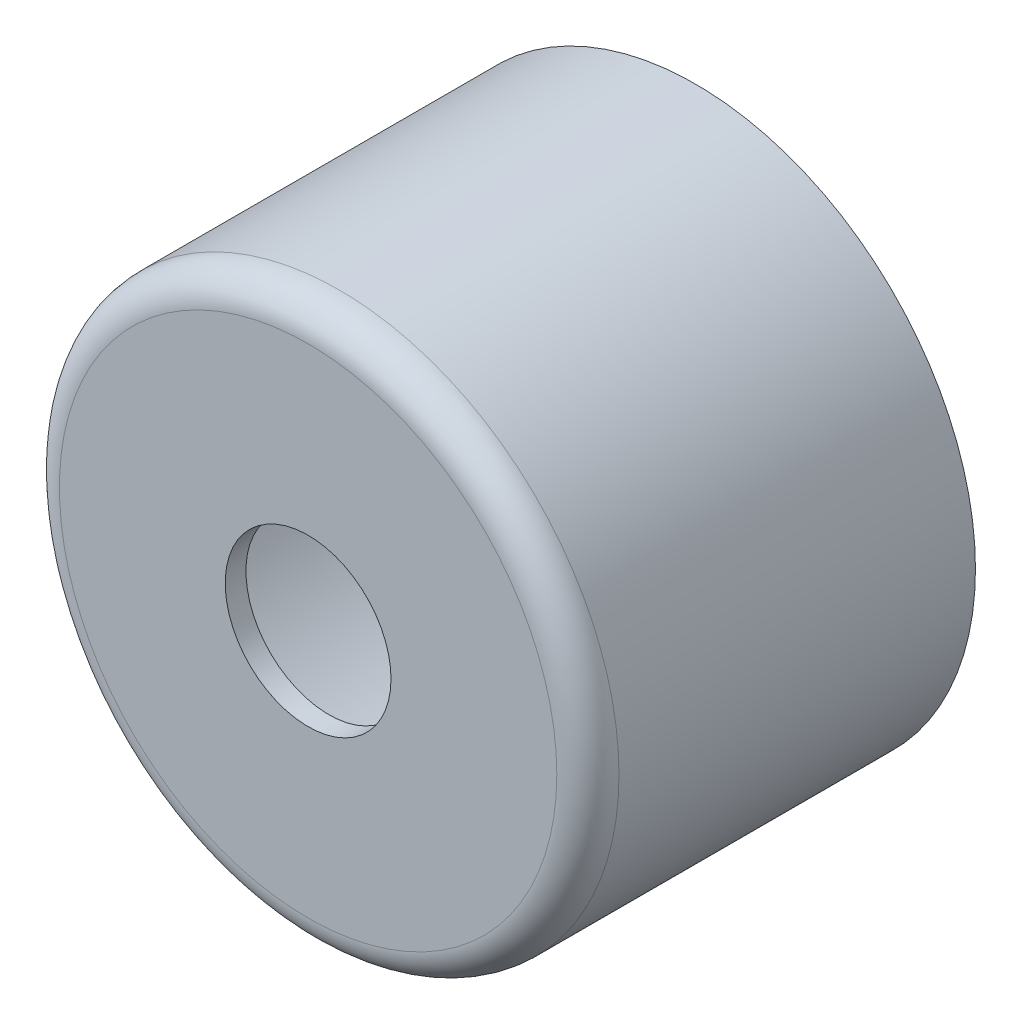
ISO-10303-21;
HEADER;
FILE_DESCRIPTION(('STEP AP214'),'2;1');
FILE_NAME('part.step','',(''),(''),'','','');
FILE_SCHEMA(('AUTOMOTIVE_DESIGN { 1 0 10303 214 1 1 1 1 }'));
ENDSEC;
DATA;
#1=APPLICATION_CONTEXT('core data for automotive mechanical design processes');
#2=APPLICATION_PROTOCOL_DEFINITION('international standard','automotive_design',2000,#1);
#3=PRODUCT_CONTEXT('',#1,'mechanical');
#4=PRODUCT('Part','Part','',(#3));
#5=PRODUCT_RELATED_PRODUCT_CATEGORY('part','',(#4));
#6=PRODUCT_DEFINITION_FORMATION('','',#4);
#7=PRODUCT_DEFINITION_CONTEXT('part definition',#1,'design');
#8=PRODUCT_DEFINITION('design','',#6,#7);
#9=PRODUCT_DEFINITION_SHAPE('','',#8);
#10=(LENGTH_UNIT() NAMED_UNIT(*) SI_UNIT(.MILLI.,.METRE.));
#11=(NAMED_UNIT(*) PLANE_ANGLE_UNIT() SI_UNIT($,.RADIAN.));
#12=(NAMED_UNIT(*) SI_UNIT($,.STERADIAN.) SOLID_ANGLE_UNIT());
#13=UNCERTAINTY_MEASURE_WITH_UNIT(LENGTH_MEASURE(1.E-05),#10,'distance_accuracy_value','');
#14=(GEOMETRIC_REPRESENTATION_CONTEXT(3) GLOBAL_UNCERTAINTY_ASSIGNED_CONTEXT((#13)) GLOBAL_UNIT_ASSIGNED_CONTEXT((#10,
#11,#12)) REPRESENTATION_CONTEXT('',''));
#15=CARTESIAN_POINT('',(0.,0.,0.));
#16=DIRECTION('',(0.,0.,1.));
#17=DIRECTION('',(1.,0.,0.));
#18=AXIS2_PLACEMENT_3D('',#15,#16,#17);
#19=CARTESIAN_POINT('',(0.,0.,18.7));
#20=DIRECTION('',(0.,0.,-1.));
#21=DIRECTION('',(-1.,0.,0.));
#22=AXIS2_PLACEMENT_3D('',#19,#20,#21);
#23=CYLINDRICAL_SURFACE('',#22,13.5);
#24=CARTESIAN_POINT('',(0.,0.,17.2));
#25=DIRECTION('',(0.,0.,1.));
#26=DIRECTION('',(1.,0.,0.));
#27=AXIS2_PLACEMENT_3D('',#24,#25,#26);
#28=CIRCLE('',#27,13.5);
#29=CARTESIAN_POINT('',(13.5,0.,17.2));
#30=VERTEX_POINT('',#29);
#31=EDGE_CURVE('E10',#30,#30,#28,.F.);
#32=ORIENTED_EDGE('',*,*,#31,.T.);
#33=EDGE_LOOP('',(#32));
#34=FACE_BOUND('',#33,.T.);
#35=CARTESIAN_POINT('',(0.,0.,0.));
#36=DIRECTION('',(0.,0.,1.));
#37=DIRECTION('',(1.,0.,0.));
#38=AXIS2_PLACEMENT_3D('',#35,#36,#37);
#39=CIRCLE('',#38,13.5);
#40=CARTESIAN_POINT('',(13.5,0.,0.));
#41=VERTEX_POINT('',#40);
#42=EDGE_CURVE('E41',#41,#41,#39,.T.);
#43=ORIENTED_EDGE('',*,*,#42,.T.);
#44=EDGE_LOOP('',(#43));
#45=FACE_BOUND('',#44,.T.);
#46=ADVANCED_FACE('F30',(#34,#45),#23,.T.);
#47=CARTESIAN_POINT('',(0.,0.,18.7));
#48=DIRECTION('',(0.,0.,1.));
#49=DIRECTION('',(1.,0.,0.));
#50=AXIS2_PLACEMENT_3D('',#47,#48,#49);
#51=PLANE('',#50);
#52=CARTESIAN_POINT('',(0.,0.,18.7));
#53=DIRECTION('',(0.,0.,1.));
#54=DIRECTION('',(1.,0.,0.));
#55=AXIS2_PLACEMENT_3D('',#52,#53,#54);
#56=CIRCLE('',#55,4.);
#57=CARTESIAN_POINT('',(4.,0.,18.7));
#58=VERTEX_POINT('',#57);
#59=EDGE_CURVE('E55',#58,#58,#56,.T.);
#60=ORIENTED_EDGE('',*,*,#59,.F.);
#61=EDGE_LOOP('',(#60));
#62=FACE_BOUND('',#61,.T.);
#63=CARTESIAN_POINT('',(0.,0.,18.7));
#64=DIRECTION('',(0.,0.,1.));
#65=DIRECTION('',(1.,0.,0.));
#66=AXIS2_PLACEMENT_3D('',#63,#64,#65);
#67=CIRCLE('',#66,12.);
#68=CARTESIAN_POINT('',(12.,0.,18.7));
#69=VERTEX_POINT('',#68);
#70=EDGE_CURVE('E37',#69,#69,#67,.T.);
#71=ORIENTED_EDGE('',*,*,#70,.T.);
#72=EDGE_LOOP('',(#71));
#73=FACE_BOUND('',#72,.T.);
#74=ADVANCED_FACE('F76',(#62,#73),#51,.T.);
#75=CARTESIAN_POINT('',(0.,0.,0.));
#76=DIRECTION('',(0.,0.,1.));
#77=DIRECTION('',(1.,0.,0.));
#78=AXIS2_PLACEMENT_3D('',#75,#76,#77);
#79=PLANE('',#78);
#80=CARTESIAN_POINT('',(0.,0.,0.));
#81=DIRECTION('',(0.,0.,1.));
#82=DIRECTION('',(1.,0.,0.));
#83=AXIS2_PLACEMENT_3D('',#80,#81,#82);
#84=CIRCLE('',#83,12.5);
#85=CARTESIAN_POINT('',(12.5,0.,0.));
#86=VERTEX_POINT('',#85);
#87=EDGE_CURVE('E47',#86,#86,#84,.T.);
#88=ORIENTED_EDGE('',*,*,#87,.T.);
#89=EDGE_LOOP('',(#88));
#90=FACE_BOUND('',#89,.T.);
#91=ORIENTED_EDGE('',*,*,#42,.F.);
#92=EDGE_LOOP('',(#91));
#93=FACE_BOUND('',#92,.T.);
#94=ADVANCED_FACE('F80',(#90,#93),#79,.F.);
#95=CARTESIAN_POINT('',(0.,0.,17.2));
#96=DIRECTION('',(0.,0.,1.));
#97=DIRECTION('',(1.,0.,0.));
#98=AXIS2_PLACEMENT_3D('',#95,#96,#97);
#99=TOROIDAL_SURFACE('',#98,12.,1.5);
#100=ORIENTED_EDGE('',*,*,#31,.F.);
#101=EDGE_LOOP('',(#100));
#102=FACE_BOUND('',#101,.T.);
#103=ORIENTED_EDGE('',*,*,#70,.F.);
#104=EDGE_LOOP('',(#103));
#105=FACE_BOUND('',#104,.T.);
#106=ADVANCED_FACE('F86',(#102,#105),#99,.T.);
#107=CARTESIAN_POINT('',(0.,0.,18.7));
#108=DIRECTION('',(0.,0.,-1.));
#109=DIRECTION('',(-1.,0.,0.));
#110=AXIS2_PLACEMENT_3D('',#107,#108,#109);
#111=CYLINDRICAL_SURFACE('',#110,12.5);
#112=CARTESIAN_POINT('',(0.,0.,17.2));
#113=DIRECTION('',(0.,0.,-1.));
#114=DIRECTION('',(-1.,0.,0.));
#115=AXIS2_PLACEMENT_3D('',#112,#113,#114);
#116=CIRCLE('',#115,12.5);
#117=CARTESIAN_POINT('',(-12.5,0.,17.2));
#118=VERTEX_POINT('',#117);
#119=EDGE_CURVE('E46',#118,#118,#116,.T.);
#120=ORIENTED_EDGE('',*,*,#119,.F.);
#121=EDGE_LOOP('',(#120));
#122=FACE_BOUND('',#121,.T.);
#123=ORIENTED_EDGE('',*,*,#87,.F.);
#124=EDGE_LOOP('',(#123));
#125=FACE_BOUND('',#124,.T.);
#126=ADVANCED_FACE('F92',(#122,#125),#111,.F.);
#127=CARTESIAN_POINT('',(0.,0.,17.7));
#128=DIRECTION('',(0.,0.,1.));
#129=DIRECTION('',(1.,0.,0.));
#130=AXIS2_PLACEMENT_3D('',#127,#128,#129);
#131=PLANE('',#130);
#132=CARTESIAN_POINT('',(0.,0.,17.7));
#133=DIRECTION('',(0.,0.,1.));
#134=DIRECTION('',(1.,0.,0.));
#135=AXIS2_PLACEMENT_3D('',#132,#133,#134);
#136=CIRCLE('',#135,4.);
#137=CARTESIAN_POINT('',(4.,0.,17.7));
#138=VERTEX_POINT('',#137);
#139=EDGE_CURVE('E33',#138,#138,#136,.T.);
#140=ORIENTED_EDGE('',*,*,#139,.T.);
#141=EDGE_LOOP('',(#140));
#142=FACE_BOUND('',#141,.T.);
#143=CARTESIAN_POINT('',(0.,0.,17.7));
#144=DIRECTION('',(0.,0.,1.));
#145=DIRECTION('',(1.,0.,0.));
#146=AXIS2_PLACEMENT_3D('',#143,#144,#145);
#147=CIRCLE('',#146,12.);
#148=CARTESIAN_POINT('',(12.,0.,17.7));
#149=VERTEX_POINT('',#148);
#150=EDGE_CURVE('E50',#149,#149,#147,.T.);
#151=ORIENTED_EDGE('',*,*,#150,.F.);
#152=EDGE_LOOP('',(#151));
#153=FACE_BOUND('',#152,.T.);
#154=ADVANCED_FACE('F62',(#142,#153),#131,.F.);
#155=CARTESIAN_POINT('',(0.,0.,17.2));
#156=DIRECTION('',(0.,0.,1.));
#157=DIRECTION('',(1.,0.,0.));
#158=AXIS2_PLACEMENT_3D('',#155,#156,#157);
#159=TOROIDAL_SURFACE('',#158,12.,0.5);
#160=ORIENTED_EDGE('',*,*,#119,.T.);
#161=EDGE_LOOP('',(#160));
#162=FACE_BOUND('',#161,.T.);
#163=ORIENTED_EDGE('',*,*,#150,.T.);
#164=EDGE_LOOP('',(#163));
#165=FACE_BOUND('',#164,.T.);
#166=ADVANCED_FACE('F67',(#162,#165),#159,.F.);
#167=CARTESIAN_POINT('',(0.,0.,0.));
#168=DIRECTION('',(0.,0.,1.));
#169=DIRECTION('',(1.,0.,0.));
#170=AXIS2_PLACEMENT_3D('',#167,#168,#169);
#171=CYLINDRICAL_SURFACE('',#170,4.);
#172=ORIENTED_EDGE('',*,*,#59,.T.);
#173=EDGE_LOOP('',(#172));
#174=FACE_BOUND('',#173,.T.);
#175=ORIENTED_EDGE('',*,*,#139,.F.);
#176=EDGE_LOOP('',(#175));
#177=FACE_BOUND('',#176,.T.);
#178=ADVANCED_FACE('F65',(#174,#177),#171,.F.);
#179=CLOSED_SHELL('',(#46,#74,#94,#106,#126,#154,#166,#178));
#180=MANIFOLD_SOLID_BREP('B2',#179);
#181=ADVANCED_BREP_SHAPE_REPRESENTATION('',(#18,#180),#14);
#182=SHAPE_DEFINITION_REPRESENTATION(#9,#181);
ENDSEC;
END-ISO-10303-21;
